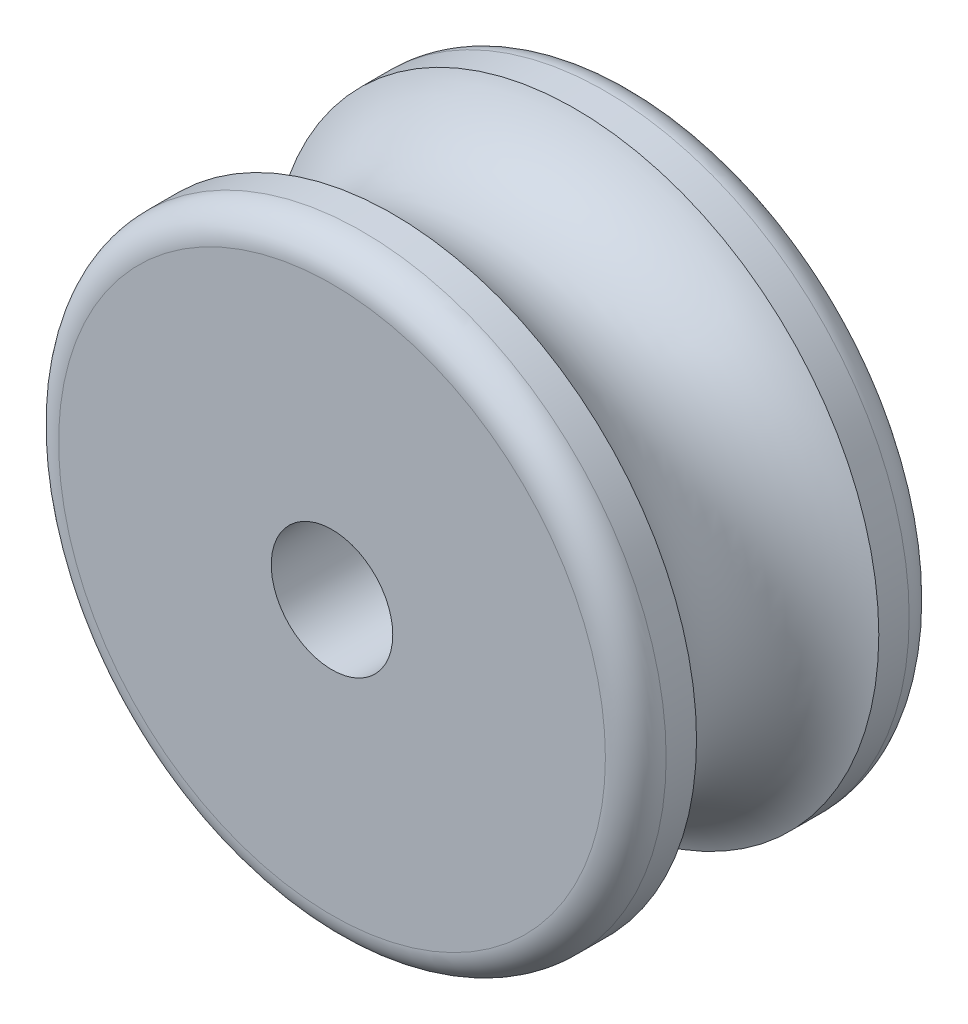
ISO-10303-21;
HEADER;
FILE_DESCRIPTION(('STEP AP214'),'2;1');
FILE_NAME('part.step','',(''),(''),'','','');
FILE_SCHEMA(('AUTOMOTIVE_DESIGN { 1 0 10303 214 1 1 1 1 }'));
ENDSEC;
DATA;
#1=APPLICATION_CONTEXT('core data for automotive mechanical design processes');
#2=APPLICATION_PROTOCOL_DEFINITION('international standard','automotive_design',2000,#1);
#3=PRODUCT_CONTEXT('',#1,'mechanical');
#4=PRODUCT('Part','Part','',(#3));
#5=PRODUCT_RELATED_PRODUCT_CATEGORY('part','',(#4));
#6=PRODUCT_DEFINITION_FORMATION('','',#4);
#7=PRODUCT_DEFINITION_CONTEXT('part definition',#1,'design');
#8=PRODUCT_DEFINITION('design','',#6,#7);
#9=PRODUCT_DEFINITION_SHAPE('','',#8);
#10=(LENGTH_UNIT() NAMED_UNIT(*) SI_UNIT(.MILLI.,.METRE.));
#11=(NAMED_UNIT(*) PLANE_ANGLE_UNIT() SI_UNIT($,.RADIAN.));
#12=(NAMED_UNIT(*) SI_UNIT($,.STERADIAN.) SOLID_ANGLE_UNIT());
#13=UNCERTAINTY_MEASURE_WITH_UNIT(LENGTH_MEASURE(1.E-05),#10,'distance_accuracy_value','');
#14=(GEOMETRIC_REPRESENTATION_CONTEXT(3) GLOBAL_UNCERTAINTY_ASSIGNED_CONTEXT((#13)) GLOBAL_UNIT_ASSIGNED_CONTEXT((#10,
#11,#12)) REPRESENTATION_CONTEXT('',''));
#15=CARTESIAN_POINT('',(0.,0.,0.));
#16=DIRECTION('',(0.,0.,1.));
#17=DIRECTION('',(1.,0.,0.));
#18=AXIS2_PLACEMENT_3D('',#15,#16,#17);
#19=CARTESIAN_POINT('',(0.,0.,5.));
#20=DIRECTION('',(0.,0.,-1.));
#21=DIRECTION('',(-1.,0.,0.));
#22=AXIS2_PLACEMENT_3D('',#19,#20,#21);
#23=CYLINDRICAL_SURFACE('',#22,5.);
#24=CARTESIAN_POINT('',(0.,0.,4.5));
#25=DIRECTION('',(0.,0.,1.));
#26=DIRECTION('',(1.,0.,0.));
#27=AXIS2_PLACEMENT_3D('',#24,#25,#26);
#28=CIRCLE('',#27,5.);
#29=CARTESIAN_POINT('',(5.,0.,4.5));
#30=VERTEX_POINT('',#29);
#31=EDGE_CURVE('E10',#30,#30,#28,.F.);
#32=ORIENTED_EDGE('',*,*,#31,.T.);
#33=EDGE_LOOP('',(#32));
#34=FACE_BOUND('',#33,.T.);
#35=CARTESIAN_POINT('',(0.,0.,4.));
#36=DIRECTION('',(0.,0.,1.));
#37=DIRECTION('',(1.,0.,0.));
#38=AXIS2_PLACEMENT_3D('',#35,#36,#37);
#39=CIRCLE('',#38,5.);
#40=CARTESIAN_POINT('',(5.,0.,4.));
#41=VERTEX_POINT('',#40);
#42=EDGE_CURVE('E65',#41,#41,#39,.T.);
#43=ORIENTED_EDGE('',*,*,#42,.T.);
#44=EDGE_LOOP('',(#43));
#45=FACE_BOUND('',#44,.T.);
#46=ADVANCED_FACE('F37',(#34,#45),#23,.T.);
#47=CARTESIAN_POINT('',(0.,0.,5.));
#48=DIRECTION('',(0.,0.,1.));
#49=DIRECTION('',(1.,0.,0.));
#50=AXIS2_PLACEMENT_3D('',#47,#48,#49);
#51=PLANE('',#50);
#52=CARTESIAN_POINT('',(0.,0.,5.));
#53=DIRECTION('',(0.,0.,1.));
#54=DIRECTION('',(1.,0.,0.));
#55=AXIS2_PLACEMENT_3D('',#52,#53,#54);
#56=CIRCLE('',#55,1.);
#57=CARTESIAN_POINT('',(1.,0.,5.));
#58=VERTEX_POINT('',#57);
#59=EDGE_CURVE('E70',#58,#58,#56,.T.);
#60=ORIENTED_EDGE('',*,*,#59,.F.);
#61=EDGE_LOOP('',(#60));
#62=FACE_BOUND('',#61,.T.);
#63=CARTESIAN_POINT('',(0.,0.,5.));
#64=DIRECTION('',(0.,0.,1.));
#65=DIRECTION('',(1.,0.,0.));
#66=AXIS2_PLACEMENT_3D('',#63,#64,#65);
#67=CIRCLE('',#66,4.5);
#68=CARTESIAN_POINT('',(4.5,0.,5.));
#69=VERTEX_POINT('',#68);
#70=EDGE_CURVE('E45',#69,#69,#67,.T.);
#71=ORIENTED_EDGE('',*,*,#70,.T.);
#72=EDGE_LOOP('',(#71));
#73=FACE_BOUND('',#72,.T.);
#74=ADVANCED_FACE('F87',(#62,#73),#51,.T.);
#75=CARTESIAN_POINT('',(0.,0.,2.5));
#76=DIRECTION('',(0.,0.,1.));
#77=DIRECTION('',(1.,0.,0.));
#78=AXIS2_PLACEMENT_3D('',#75,#76,#77);
#79=TOROIDAL_SURFACE('',#78,5.625,1.625);
#80=CARTESIAN_POINT('',(0.,0.,1.));
#81=DIRECTION('',(0.,0.,1.));
#82=DIRECTION('',(1.,0.,0.));
#83=AXIS2_PLACEMENT_3D('',#80,#81,#82);
#84=CIRCLE('',#83,5.);
#85=CARTESIAN_POINT('',(5.,0.,1.));
#86=VERTEX_POINT('',#85);
#87=EDGE_CURVE('E61',#86,#86,#84,.T.);
#88=ORIENTED_EDGE('',*,*,#87,.T.);
#89=EDGE_LOOP('',(#88));
#90=FACE_BOUND('',#89,.T.);
#91=ORIENTED_EDGE('',*,*,#42,.F.);
#92=EDGE_LOOP('',(#91));
#93=FACE_BOUND('',#92,.T.);
#94=ADVANCED_FACE('F89',(#90,#93),#79,.F.);
#95=CARTESIAN_POINT('',(0.,0.,0.));
#96=DIRECTION('',(0.,0.,1.));
#97=DIRECTION('',(1.,0.,0.));
#98=AXIS2_PLACEMENT_3D('',#95,#96,#97);
#99=PLANE('',#98);
#100=CARTESIAN_POINT('',(0.,0.,0.));
#101=DIRECTION('',(0.,0.,1.));
#102=DIRECTION('',(1.,0.,0.));
#103=AXIS2_PLACEMENT_3D('',#100,#101,#102);
#104=CIRCLE('',#103,1.);
#105=CARTESIAN_POINT('',(1.,0.,0.));
#106=VERTEX_POINT('',#105);
#107=EDGE_CURVE('E69',#106,#106,#104,.T.);
#108=ORIENTED_EDGE('',*,*,#107,.T.);
#109=EDGE_LOOP('',(#108));
#110=FACE_BOUND('',#109,.T.);
#111=CARTESIAN_POINT('',(0.,0.,0.));
#112=DIRECTION('',(0.,0.,1.));
#113=DIRECTION('',(1.,0.,0.));
#114=AXIS2_PLACEMENT_3D('',#111,#112,#113);
#115=CIRCLE('',#114,4.5);
#116=CARTESIAN_POINT('',(4.5,0.,0.));
#117=VERTEX_POINT('',#116);
#118=EDGE_CURVE('E50',#117,#117,#115,.F.);
#119=ORIENTED_EDGE('',*,*,#118,.T.);
#120=EDGE_LOOP('',(#119));
#121=FACE_BOUND('',#120,.T.);
#122=ADVANCED_FACE('F78',(#110,#121),#99,.F.);
#123=CARTESIAN_POINT('',(0.,0.,0.5));
#124=DIRECTION('',(0.,0.,1.));
#125=DIRECTION('',(1.,0.,0.));
#126=AXIS2_PLACEMENT_3D('',#123,#124,#125);
#127=CIRCLE('',#126,5.);
#128=CARTESIAN_POINT('',(5.,0.,0.5));
#129=VERTEX_POINT('',#128);
#130=EDGE_CURVE('E55',#129,#129,#127,.T.);
#131=ORIENTED_EDGE('',*,*,#130,.T.);
#132=EDGE_LOOP('',(#131));
#133=FACE_BOUND('',#132,.T.);
#134=ORIENTED_EDGE('',*,*,#87,.F.);
#135=EDGE_LOOP('',(#134));
#136=FACE_BOUND('',#135,.T.);
#137=ADVANCED_FACE('F98',(#133,#136),#23,.T.);
#138=CARTESIAN_POINT('',(0.,0.,0.5));
#139=DIRECTION('',(0.,0.,1.));
#140=DIRECTION('',(1.,0.,0.));
#141=AXIS2_PLACEMENT_3D('',#138,#139,#140);
#142=TOROIDAL_SURFACE('',#141,4.5,0.5);
#143=ORIENTED_EDGE('',*,*,#118,.F.);
#144=EDGE_LOOP('',(#143));
#145=FACE_BOUND('',#144,.T.);
#146=ORIENTED_EDGE('',*,*,#130,.F.);
#147=EDGE_LOOP('',(#146));
#148=FACE_BOUND('',#147,.T.);
#149=ADVANCED_FACE('F101',(#145,#148),#142,.T.);
#150=CARTESIAN_POINT('',(0.,0.,4.5));
#151=DIRECTION('',(0.,0.,1.));
#152=DIRECTION('',(1.,0.,0.));
#153=AXIS2_PLACEMENT_3D('',#150,#151,#152);
#154=TOROIDAL_SURFACE('',#153,4.5,0.5);
#155=ORIENTED_EDGE('',*,*,#31,.F.);
#156=EDGE_LOOP('',(#155));
#157=FACE_BOUND('',#156,.T.);
#158=ORIENTED_EDGE('',*,*,#70,.F.);
#159=EDGE_LOOP('',(#158));
#160=FACE_BOUND('',#159,.T.);
#161=ADVANCED_FACE('F39',(#157,#160),#154,.T.);
#162=CARTESIAN_POINT('',(0.,0.,0.));
#163=DIRECTION('',(0.,0.,1.));
#164=DIRECTION('',(1.,0.,0.));
#165=AXIS2_PLACEMENT_3D('',#162,#163,#164);
#166=CYLINDRICAL_SURFACE('',#165,1.);
#167=ORIENTED_EDGE('',*,*,#107,.F.);
#168=EDGE_LOOP('',(#167));
#169=FACE_BOUND('',#168,.T.);
#170=ORIENTED_EDGE('',*,*,#59,.T.);
#171=EDGE_LOOP('',(#170));
#172=FACE_BOUND('',#171,.T.);
#173=ADVANCED_FACE('F81',(#169,#172),#166,.F.);
#174=CLOSED_SHELL('',(#46,#74,#94,#122,#137,#149,#161,#173));
#175=MANIFOLD_SOLID_BREP('B2',#174);
#176=ADVANCED_BREP_SHAPE_REPRESENTATION('',(#18,#175),#14);
#177=SHAPE_DEFINITION_REPRESENTATION(#9,#176);
ENDSEC;
END-ISO-10303-21;
